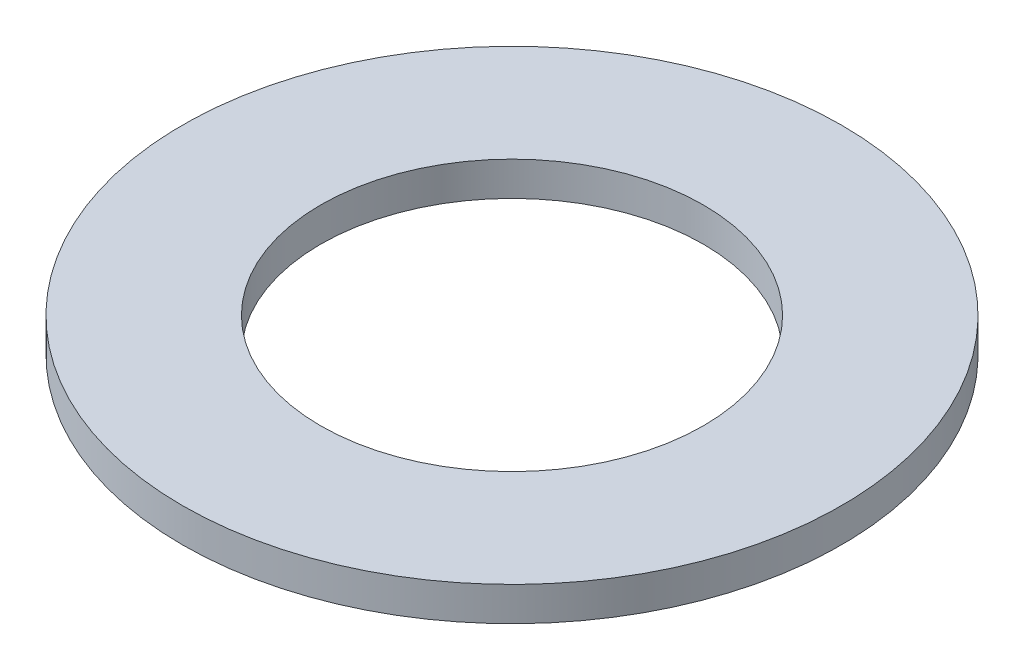
ISO-10303-21;
HEADER;
FILE_DESCRIPTION(('STEP AP214'),'2;1');
FILE_NAME('part.step','',(''),(''),'','','');
FILE_SCHEMA(('AUTOMOTIVE_DESIGN { 1 0 10303 214 1 1 1 1 }'));
ENDSEC;
DATA;
#1=APPLICATION_CONTEXT('core data for automotive mechanical design processes');
#2=APPLICATION_PROTOCOL_DEFINITION('international standard','automotive_design',2000,#1);
#3=PRODUCT_CONTEXT('',#1,'mechanical');
#4=PRODUCT('Part','Part','',(#3));
#5=PRODUCT_RELATED_PRODUCT_CATEGORY('part','',(#4));
#6=PRODUCT_DEFINITION_FORMATION('','',#4);
#7=PRODUCT_DEFINITION_CONTEXT('part definition',#1,'design');
#8=PRODUCT_DEFINITION('design','',#6,#7);
#9=PRODUCT_DEFINITION_SHAPE('','',#8);
#10=(LENGTH_UNIT() NAMED_UNIT(*) SI_UNIT(.MILLI.,.METRE.));
#11=(NAMED_UNIT(*) PLANE_ANGLE_UNIT() SI_UNIT($,.RADIAN.));
#12=(NAMED_UNIT(*) SI_UNIT($,.STERADIAN.) SOLID_ANGLE_UNIT());
#13=UNCERTAINTY_MEASURE_WITH_UNIT(LENGTH_MEASURE(1.E-05),#10,'distance_accuracy_value','');
#14=(GEOMETRIC_REPRESENTATION_CONTEXT(3) GLOBAL_UNCERTAINTY_ASSIGNED_CONTEXT((#13)) GLOBAL_UNIT_ASSIGNED_CONTEXT((#10,
#11,#12)) REPRESENTATION_CONTEXT('',''));
#15=CARTESIAN_POINT('',(0.,0.,0.));
#16=DIRECTION('',(0.,0.,1.));
#17=DIRECTION('',(1.,0.,0.));
#18=AXIS2_PLACEMENT_3D('',#15,#16,#17);
#19=CARTESIAN_POINT('',(0.,8.,0.));
#20=DIRECTION('',(0.,-1.,0.));
#21=DIRECTION('',(0.,0.,-1.));
#22=AXIS2_PLACEMENT_3D('',#19,#20,#21);
#23=CYLINDRICAL_SURFACE('',#22,77.5);
#24=CARTESIAN_POINT('',(0.,8.,0.));
#25=DIRECTION('',(0.,1.,0.));
#26=DIRECTION('',(0.,0.,1.));
#27=AXIS2_PLACEMENT_3D('',#24,#25,#26);
#28=CIRCLE('',#27,77.5);
#29=CARTESIAN_POINT('',(0.,8.,77.5));
#30=VERTEX_POINT('',#29);
#31=EDGE_CURVE('E10',#30,#30,#28,.T.);
#32=ORIENTED_EDGE('',*,*,#31,.F.);
#33=EDGE_LOOP('',(#32));
#34=FACE_BOUND('',#33,.T.);
#35=CARTESIAN_POINT('',(0.,0.,0.));
#36=DIRECTION('',(0.,1.,0.));
#37=DIRECTION('',(0.,0.,1.));
#38=AXIS2_PLACEMENT_3D('',#35,#36,#37);
#39=CIRCLE('',#38,77.5);
#40=CARTESIAN_POINT('',(0.,0.,77.5));
#41=VERTEX_POINT('',#40);
#42=EDGE_CURVE('E37',#41,#41,#39,.T.);
#43=ORIENTED_EDGE('',*,*,#42,.T.);
#44=EDGE_LOOP('',(#43));
#45=FACE_BOUND('',#44,.T.);
#46=ADVANCED_FACE('F40',(#34,#45),#23,.T.);
#47=CARTESIAN_POINT('',(0.,8.,0.));
#48=DIRECTION('',(0.,1.,0.));
#49=DIRECTION('',(0.,0.,1.));
#50=AXIS2_PLACEMENT_3D('',#47,#48,#49);
#51=PLANE('',#50);
#52=CARTESIAN_POINT('',(0.,8.,0.));
#53=DIRECTION('',(0.,1.,0.));
#54=DIRECTION('',(0.,0.,1.));
#55=AXIS2_PLACEMENT_3D('',#52,#53,#54);
#56=CIRCLE('',#55,45.);
#57=CARTESIAN_POINT('',(0.,8.,45.));
#58=VERTEX_POINT('',#57);
#59=EDGE_CURVE('E50',#58,#58,#56,.T.);
#60=ORIENTED_EDGE('',*,*,#59,.F.);
#61=EDGE_LOOP('',(#60));
#62=FACE_BOUND('',#61,.T.);
#63=ORIENTED_EDGE('',*,*,#31,.T.);
#64=EDGE_LOOP('',(#63));
#65=FACE_BOUND('',#64,.T.);
#66=ADVANCED_FACE('F59',(#62,#65),#51,.T.);
#67=CARTESIAN_POINT('',(0.,0.,0.));
#68=DIRECTION('',(0.,1.,0.));
#69=DIRECTION('',(0.,0.,1.));
#70=AXIS2_PLACEMENT_3D('',#67,#68,#69);
#71=PLANE('',#70);
#72=CARTESIAN_POINT('',(0.,0.,0.));
#73=DIRECTION('',(0.,1.,0.));
#74=DIRECTION('',(0.,0.,1.));
#75=AXIS2_PLACEMENT_3D('',#72,#73,#74);
#76=CIRCLE('',#75,45.);
#77=CARTESIAN_POINT('',(0.,0.,45.));
#78=VERTEX_POINT('',#77);
#79=EDGE_CURVE('E47',#78,#78,#76,.T.);
#80=ORIENTED_EDGE('',*,*,#79,.T.);
#81=EDGE_LOOP('',(#80));
#82=FACE_BOUND('',#81,.T.);
#83=ORIENTED_EDGE('',*,*,#42,.F.);
#84=EDGE_LOOP('',(#83));
#85=FACE_BOUND('',#84,.T.);
#86=ADVANCED_FACE('F58',(#82,#85),#71,.F.);
#87=CARTESIAN_POINT('',(0.,8.,0.));
#88=DIRECTION('',(0.,-1.,0.));
#89=DIRECTION('',(0.,0.,-1.));
#90=AXIS2_PLACEMENT_3D('',#87,#88,#89);
#91=CYLINDRICAL_SURFACE('',#90,45.);
#92=ORIENTED_EDGE('',*,*,#59,.T.);
#93=EDGE_LOOP('',(#92));
#94=FACE_BOUND('',#93,.T.);
#95=ORIENTED_EDGE('',*,*,#79,.F.);
#96=EDGE_LOOP('',(#95));
#97=FACE_BOUND('',#96,.T.);
#98=ADVANCED_FACE('F54',(#94,#97),#91,.F.);
#99=CLOSED_SHELL('',(#46,#66,#86,#98));
#100=MANIFOLD_SOLID_BREP('B2',#99);
#101=ADVANCED_BREP_SHAPE_REPRESENTATION('',(#18,#100),#14);
#102=SHAPE_DEFINITION_REPRESENTATION(#9,#101);
ENDSEC;
END-ISO-10303-21;
